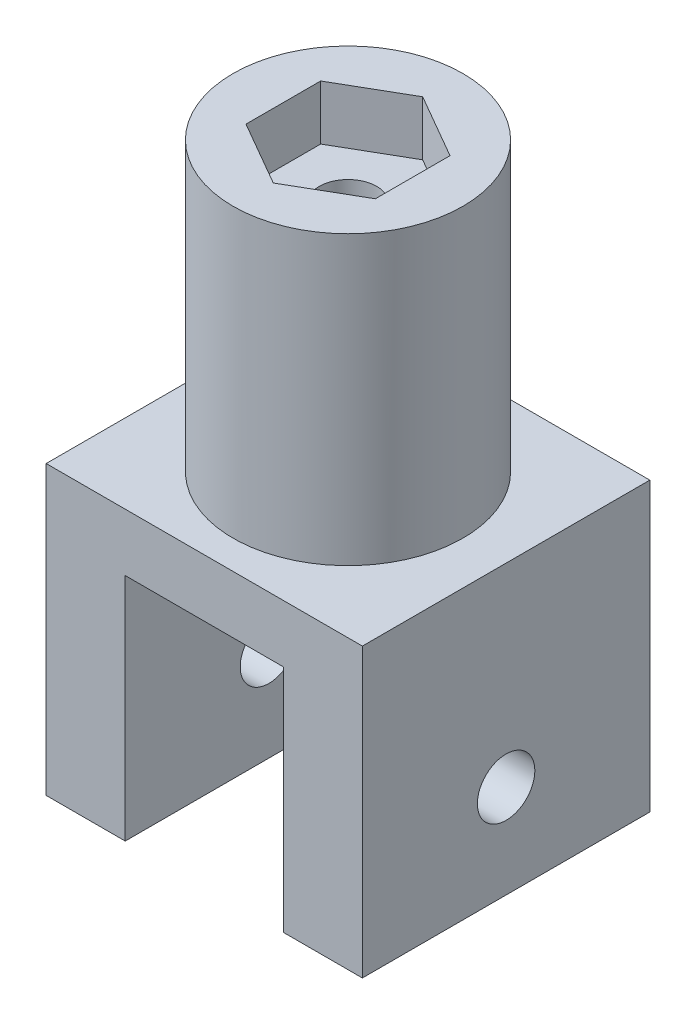
ISO-10303-21;
HEADER;
FILE_DESCRIPTION(('STEP AP214'),'2;1');
FILE_NAME('part.step','',(''),(''),'','','');
FILE_SCHEMA(('AUTOMOTIVE_DESIGN { 1 0 10303 214 1 1 1 1 }'));
ENDSEC;
DATA;
#1=APPLICATION_CONTEXT('core data for automotive mechanical design processes');
#2=APPLICATION_PROTOCOL_DEFINITION('international standard','automotive_design',2000,#1);
#3=PRODUCT_CONTEXT('',#1,'mechanical');
#4=PRODUCT('Part','Part','',(#3));
#5=PRODUCT_RELATED_PRODUCT_CATEGORY('part','',(#4));
#6=PRODUCT_DEFINITION_FORMATION('','',#4);
#7=PRODUCT_DEFINITION_CONTEXT('part definition',#1,'design');
#8=PRODUCT_DEFINITION('design','',#6,#7);
#9=PRODUCT_DEFINITION_SHAPE('','',#8);
#10=(LENGTH_UNIT() NAMED_UNIT(*) SI_UNIT(.MILLI.,.METRE.));
#11=(NAMED_UNIT(*) PLANE_ANGLE_UNIT() SI_UNIT($,.RADIAN.));
#12=(NAMED_UNIT(*) SI_UNIT($,.STERADIAN.) SOLID_ANGLE_UNIT());
#13=UNCERTAINTY_MEASURE_WITH_UNIT(LENGTH_MEASURE(1.E-05),#10,'distance_accuracy_value','');
#14=(GEOMETRIC_REPRESENTATION_CONTEXT(3) GLOBAL_UNCERTAINTY_ASSIGNED_CONTEXT((#13)) GLOBAL_UNIT_ASSIGNED_CONTEXT((#10,
#11,#12)) REPRESENTATION_CONTEXT('',''));
#15=CARTESIAN_POINT('',(0.,0.,0.));
#16=DIRECTION('',(0.,0.,1.));
#17=DIRECTION('',(1.,0.,0.));
#18=AXIS2_PLACEMENT_3D('',#15,#16,#17);
#19=CARTESIAN_POINT('',(0.,20.,0.));
#20=DIRECTION('',(0.,1.,0.));
#21=DIRECTION('',(0.,0.,1.));
#22=AXIS2_PLACEMENT_3D('',#19,#20,#21);
#23=PLANE('',#22);
#24=DIRECTION('',(0.,0.,-1.));
#25=VECTOR('',#24,1.);
#26=CARTESIAN_POINT('',(4.5,20.,2.59807621135332));
#27=LINE('',#26,#25);
#28=CARTESIAN_POINT('',(4.5,20.,2.59807621135332));
#29=VERTEX_POINT('',#28);
#30=CARTESIAN_POINT('',(4.5,20.,-2.59807621135332));
#31=VERTEX_POINT('',#30);
#32=EDGE_CURVE('E49',#29,#31,#27,.T.);
#33=ORIENTED_EDGE('',*,*,#32,.F.);
#34=DIRECTION('',(0.866025403784439,0.,-0.5));
#35=VECTOR('',#34,1.);
#36=CARTESIAN_POINT('',(0.,20.,5.19615242270663));
#37=LINE('',#36,#35);
#38=CARTESIAN_POINT('',(0.,20.,5.19615242270663));
#39=VERTEX_POINT('',#38);
#40=EDGE_CURVE('E157',#39,#29,#37,.T.);
#41=ORIENTED_EDGE('',*,*,#40,.F.);
#42=DIRECTION('',(0.866025403784439,0.,0.5));
#43=VECTOR('',#42,1.);
#44=CARTESIAN_POINT('',(-4.5,20.,2.59807621135332));
#45=LINE('',#44,#43);
#46=CARTESIAN_POINT('',(-4.5,20.,2.59807621135332));
#47=VERTEX_POINT('',#46);
#48=EDGE_CURVE('E160',#47,#39,#45,.T.);
#49=ORIENTED_EDGE('',*,*,#48,.F.);
#50=DIRECTION('',(0.,0.,1.));
#51=VECTOR('',#50,1.);
#52=CARTESIAN_POINT('',(-4.5,20.,-2.59807621135332));
#53=LINE('',#52,#51);
#54=CARTESIAN_POINT('',(-4.5,20.,-2.59807621135332));
#55=VERTEX_POINT('',#54);
#56=EDGE_CURVE('E176',#55,#47,#53,.T.);
#57=ORIENTED_EDGE('',*,*,#56,.F.);
#58=DIRECTION('',(-0.866025403784439,0.,0.5));
#59=VECTOR('',#58,1.);
#60=CARTESIAN_POINT('',(0.,20.,-5.19615242270663));
#61=LINE('',#60,#59);
#62=CARTESIAN_POINT('',(0.,20.,-5.19615242270663));
#63=VERTEX_POINT('',#62);
#64=EDGE_CURVE('E173',#63,#55,#61,.T.);
#65=ORIENTED_EDGE('',*,*,#64,.F.);
#66=DIRECTION('',(-0.866025403784439,0.,-0.5));
#67=VECTOR('',#66,1.);
#68=CARTESIAN_POINT('',(4.5,20.,-2.59807621135332));
#69=LINE('',#68,#67);
#70=EDGE_CURVE('E171',#31,#63,#69,.T.);
#71=ORIENTED_EDGE('',*,*,#70,.F.);
#72=EDGE_LOOP('',(#33,#41,#49,#57,#65,#71));
#73=FACE_BOUND('',#72,.T.);
#74=CARTESIAN_POINT('',(0.,20.,0.));
#75=DIRECTION('',(0.,1.,0.));
#76=DIRECTION('',(0.,0.,1.));
#77=AXIS2_PLACEMENT_3D('',#74,#75,#76);
#78=CIRCLE('',#77,8.);
#79=CARTESIAN_POINT('',(0.,20.,8.));
#80=VERTEX_POINT('',#79);
#81=EDGE_CURVE('E191',#80,#80,#78,.T.);
#82=ORIENTED_EDGE('',*,*,#81,.T.);
#83=EDGE_LOOP('',(#82));
#84=FACE_BOUND('',#83,.T.);
#85=ADVANCED_FACE('F33',(#73,#84),#23,.T.);
#86=CARTESIAN_POINT('',(0.,42.6274169979695,0.));
#87=DIRECTION('',(0.,-1.,0.));
#88=DIRECTION('',(0.,0.,-1.));
#89=AXIS2_PLACEMENT_3D('',#86,#87,#88);
#90=CYLINDRICAL_SURFACE('',#89,8.);
#91=CARTESIAN_POINT('',(0.,0.,0.));
#92=DIRECTION('',(0.,-1.,0.));
#93=DIRECTION('',(0.,0.,-1.));
#94=AXIS2_PLACEMENT_3D('',#91,#92,#93);
#95=CIRCLE('',#94,8.);
#96=CARTESIAN_POINT('',(0.,0.,-8.));
#97=VERTEX_POINT('',#96);
#98=EDGE_CURVE('E11',#97,#97,#95,.F.);
#99=ORIENTED_EDGE('',*,*,#98,.T.);
#100=EDGE_LOOP('',(#99));
#101=FACE_BOUND('',#100,.T.);
#102=ORIENTED_EDGE('',*,*,#81,.F.);
#103=EDGE_LOOP('',(#102));
#104=FACE_BOUND('',#103,.T.);
#105=ADVANCED_FACE('F280',(#101,#104),#90,.T.);
#106=CARTESIAN_POINT('',(-11.,-13.5,0.));
#107=DIRECTION('',(1.,0.,0.));
#108=DIRECTION('',(0.,0.,-1.));
#109=AXIS2_PLACEMENT_3D('',#106,#107,#108);
#110=CYLINDRICAL_SURFACE('',#109,2.);
#111=CARTESIAN_POINT('',(-5.5,-13.5,0.));
#112=DIRECTION('',(1.,0.,0.));
#113=DIRECTION('',(0.,0.,-1.));
#114=AXIS2_PLACEMENT_3D('',#111,#112,#113);
#115=CIRCLE('',#114,2.);
#116=CARTESIAN_POINT('',(-5.5,-13.5,-2.));
#117=VERTEX_POINT('',#116);
#118=EDGE_CURVE('E198',#117,#117,#115,.T.);
#119=ORIENTED_EDGE('',*,*,#118,.T.);
#120=EDGE_LOOP('',(#119));
#121=FACE_BOUND('',#120,.T.);
#122=CARTESIAN_POINT('',(-11.,-13.5,0.));
#123=DIRECTION('',(1.,0.,0.));
#124=DIRECTION('',(0.,0.,-1.));
#125=AXIS2_PLACEMENT_3D('',#122,#123,#124);
#126=CIRCLE('',#125,2.);
#127=CARTESIAN_POINT('',(-11.,-13.5,-2.));
#128=VERTEX_POINT('',#127);
#129=EDGE_CURVE('E195',#128,#128,#126,.T.);
#130=ORIENTED_EDGE('',*,*,#129,.F.);
#131=EDGE_LOOP('',(#130));
#132=FACE_BOUND('',#131,.T.);
#133=ADVANCED_FACE('F285',(#121,#132),#110,.F.);
#134=CARTESIAN_POINT('',(5.5,0.,-30.7424685126915));
#135=DIRECTION('',(-1.,0.,0.));
#136=DIRECTION('',(0.,0.,1.));
#137=AXIS2_PLACEMENT_3D('',#134,#135,#136);
#138=PLANE('',#137);
#139=CARTESIAN_POINT('',(5.5,-13.5,0.));
#140=DIRECTION('',(-1.,0.,0.));
#141=DIRECTION('',(0.,0.,1.));
#142=AXIS2_PLACEMENT_3D('',#139,#140,#141);
#143=CIRCLE('',#142,2.);
#144=CARTESIAN_POINT('',(5.5,-13.5,2.));
#145=VERTEX_POINT('',#144);
#146=EDGE_CURVE('E201',#145,#145,#143,.T.);
#147=ORIENTED_EDGE('',*,*,#146,.F.);
#148=EDGE_LOOP('',(#147));
#149=FACE_BOUND('',#148,.T.);
#150=DIRECTION('',(0.,-1.,0.));
#151=VECTOR('',#150,1.);
#152=CARTESIAN_POINT('',(5.5,0.,10.));
#153=LINE('',#152,#151);
#154=CARTESIAN_POINT('',(5.5,-4.,10.));
#155=VERTEX_POINT('',#154);
#156=CARTESIAN_POINT('',(5.5,-20.,10.));
#157=VERTEX_POINT('',#156);
#158=EDGE_CURVE('E222',#155,#157,#153,.T.);
#159=ORIENTED_EDGE('',*,*,#158,.F.);
#160=DIRECTION('',(0.,0.,-1.));
#161=VECTOR('',#160,1.);
#162=CARTESIAN_POINT('',(5.5,-4.,0.));
#163=LINE('',#162,#161);
#164=CARTESIAN_POINT('',(5.5,-4.,-10.));
#165=VERTEX_POINT('',#164);
#166=EDGE_CURVE('E229',#155,#165,#163,.T.);
#167=ORIENTED_EDGE('',*,*,#166,.T.);
#168=DIRECTION('',(0.,1.,0.));
#169=VECTOR('',#168,1.);
#170=CARTESIAN_POINT('',(5.5,0.,-10.));
#171=LINE('',#170,#169);
#172=CARTESIAN_POINT('',(5.5,-20.,-10.));
#173=VERTEX_POINT('',#172);
#174=EDGE_CURVE('E223',#173,#165,#171,.T.);
#175=ORIENTED_EDGE('',*,*,#174,.F.);
#176=DIRECTION('',(0.,0.,1.));
#177=VECTOR('',#176,1.);
#178=CARTESIAN_POINT('',(5.5,-20.,-30.7424685126915));
#179=LINE('',#178,#177);
#180=EDGE_CURVE('E234',#173,#157,#179,.T.);
#181=ORIENTED_EDGE('',*,*,#180,.T.);
#182=EDGE_LOOP('',(#159,#167,#175,#181));
#183=FACE_BOUND('',#182,.T.);
#184=ADVANCED_FACE('F319',(#149,#183),#138,.T.);
#185=CARTESIAN_POINT('',(-11.,-20.,-30.7424685126915));
#186=DIRECTION('',(0.,-1.,0.));
#187=DIRECTION('',(0.,0.,-1.));
#188=AXIS2_PLACEMENT_3D('',#185,#186,#187);
#189=PLANE('',#188);
#190=DIRECTION('',(-1.,0.,0.));
#191=VECTOR('',#190,1.);
#192=CARTESIAN_POINT('',(-11.,-20.,-10.));
#193=LINE('',#192,#191);
#194=CARTESIAN_POINT('',(-5.5,-20.,-10.));
#195=VERTEX_POINT('',#194);
#196=CARTESIAN_POINT('',(-11.,-20.,-10.));
#197=VERTEX_POINT('',#196);
#198=EDGE_CURVE('E207',#195,#197,#193,.T.);
#199=ORIENTED_EDGE('',*,*,#198,.F.);
#200=DIRECTION('',(0.,0.,1.));
#201=VECTOR('',#200,1.);
#202=CARTESIAN_POINT('',(-5.5,-20.,-30.7424685126915));
#203=LINE('',#202,#201);
#204=CARTESIAN_POINT('',(-5.5,-20.,10.));
#205=VERTEX_POINT('',#204);
#206=EDGE_CURVE('E208',#195,#205,#203,.T.);
#207=ORIENTED_EDGE('',*,*,#206,.T.);
#208=DIRECTION('',(1.,0.,0.));
#209=VECTOR('',#208,1.);
#210=CARTESIAN_POINT('',(-11.,-20.,10.));
#211=LINE('',#210,#209);
#212=CARTESIAN_POINT('',(-11.,-20.,10.));
#213=VERTEX_POINT('',#212);
#214=EDGE_CURVE('E204',#213,#205,#211,.T.);
#215=ORIENTED_EDGE('',*,*,#214,.F.);
#216=DIRECTION('',(0.,0.,1.));
#217=VECTOR('',#216,1.);
#218=CARTESIAN_POINT('',(-11.,-20.,-30.7424685126915));
#219=LINE('',#218,#217);
#220=EDGE_CURVE('E214',#197,#213,#219,.T.);
#221=ORIENTED_EDGE('',*,*,#220,.F.);
#222=EDGE_LOOP('',(#199,#207,#215,#221));
#223=FACE_BOUND('',#222,.T.);
#224=ADVANCED_FACE('F326',(#223),#189,.T.);
#225=CARTESIAN_POINT('',(-5.5,0.,-30.7424685126915));
#226=DIRECTION('',(1.,0.,0.));
#227=DIRECTION('',(0.,0.,-1.));
#228=AXIS2_PLACEMENT_3D('',#225,#226,#227);
#229=PLANE('',#228);
#230=ORIENTED_EDGE('',*,*,#118,.F.);
#231=EDGE_LOOP('',(#230));
#232=FACE_BOUND('',#231,.T.);
#233=DIRECTION('',(0.,-1.,0.));
#234=VECTOR('',#233,1.);
#235=CARTESIAN_POINT('',(-5.5,0.,-10.));
#236=LINE('',#235,#234);
#237=CARTESIAN_POINT('',(-5.5,-4.,-10.));
#238=VERTEX_POINT('',#237);
#239=EDGE_CURVE('E205',#238,#195,#236,.T.);
#240=ORIENTED_EDGE('',*,*,#239,.F.);
#241=DIRECTION('',(0.,0.,1.));
#242=VECTOR('',#241,1.);
#243=CARTESIAN_POINT('',(-5.5,-4.,0.));
#244=LINE('',#243,#242);
#245=CARTESIAN_POINT('',(-5.5,-4.,10.));
#246=VERTEX_POINT('',#245);
#247=EDGE_CURVE('E220',#238,#246,#244,.T.);
#248=ORIENTED_EDGE('',*,*,#247,.T.);
#249=DIRECTION('',(0.,1.,0.));
#250=VECTOR('',#249,1.);
#251=CARTESIAN_POINT('',(-5.5,0.,10.));
#252=LINE('',#251,#250);
#253=EDGE_CURVE('E211',#205,#246,#252,.T.);
#254=ORIENTED_EDGE('',*,*,#253,.F.);
#255=ORIENTED_EDGE('',*,*,#206,.F.);
#256=EDGE_LOOP('',(#240,#248,#254,#255));
#257=FACE_BOUND('',#256,.T.);
#258=ADVANCED_FACE('F322',(#232,#257),#229,.T.);
#259=CARTESIAN_POINT('',(0.,-4.,0.));
#260=DIRECTION('',(0.,-1.,0.));
#261=DIRECTION('',(0.,0.,-1.));
#262=AXIS2_PLACEMENT_3D('',#259,#260,#261);
#263=PLANE('',#262);
#264=CARTESIAN_POINT('',(0.,-4.,0.));
#265=DIRECTION('',(0.,-1.,0.));
#266=DIRECTION('',(0.,0.,-1.));
#267=AXIS2_PLACEMENT_3D('',#264,#265,#266);
#268=CIRCLE('',#267,2.);
#269=CARTESIAN_POINT('',(0.,-4.,-2.));
#270=VERTEX_POINT('',#269);
#271=EDGE_CURVE('E36',#270,#270,#268,.T.);
#272=ORIENTED_EDGE('',*,*,#271,.F.);
#273=EDGE_LOOP('',(#272));
#274=FACE_BOUND('',#273,.T.);
#275=ORIENTED_EDGE('',*,*,#247,.F.);
#276=DIRECTION('',(1.,0.,0.));
#277=VECTOR('',#276,1.);
#278=CARTESIAN_POINT('',(-11.,-4.,-10.));
#279=LINE('',#278,#277);
#280=EDGE_CURVE('E243',#238,#165,#279,.T.);
#281=ORIENTED_EDGE('',*,*,#280,.T.);
#282=ORIENTED_EDGE('',*,*,#166,.F.);
#283=DIRECTION('',(-1.,0.,0.));
#284=VECTOR('',#283,1.);
#285=CARTESIAN_POINT('',(-11.,-4.,10.));
#286=LINE('',#285,#284);
#287=EDGE_CURVE('E57',#155,#246,#286,.T.);
#288=ORIENTED_EDGE('',*,*,#287,.T.);
#289=EDGE_LOOP('',(#275,#281,#282,#288));
#290=FACE_BOUND('',#289,.T.);
#291=ADVANCED_FACE('F325',(#274,#290),#263,.T.);
#292=CARTESIAN_POINT('',(11.,-20.,-30.7424685126915));
#293=DIRECTION('',(0.,-1.,0.));
#294=DIRECTION('',(0.,0.,-1.));
#295=AXIS2_PLACEMENT_3D('',#292,#293,#294);
#296=PLANE('',#295);
#297=DIRECTION('',(-1.,0.,0.));
#298=VECTOR('',#297,1.);
#299=CARTESIAN_POINT('',(11.,-20.,-10.));
#300=LINE('',#299,#298);
#301=CARTESIAN_POINT('',(11.,-20.,-10.));
#302=VERTEX_POINT('',#301);
#303=EDGE_CURVE('E226',#302,#173,#300,.T.);
#304=ORIENTED_EDGE('',*,*,#303,.F.);
#305=DIRECTION('',(0.,0.,1.));
#306=VECTOR('',#305,1.);
#307=CARTESIAN_POINT('',(11.,-20.,-30.7424685126915));
#308=LINE('',#307,#306);
#309=CARTESIAN_POINT('',(11.,-20.,10.));
#310=VERTEX_POINT('',#309);
#311=EDGE_CURVE('E227',#302,#310,#308,.T.);
#312=ORIENTED_EDGE('',*,*,#311,.T.);
#313=DIRECTION('',(1.,0.,0.));
#314=VECTOR('',#313,1.);
#315=CARTESIAN_POINT('',(11.,-20.,10.));
#316=LINE('',#315,#314);
#317=EDGE_CURVE('E231',#157,#310,#316,.T.);
#318=ORIENTED_EDGE('',*,*,#317,.F.);
#319=ORIENTED_EDGE('',*,*,#180,.F.);
#320=EDGE_LOOP('',(#304,#312,#318,#319));
#321=FACE_BOUND('',#320,.T.);
#322=ADVANCED_FACE('F331',(#321),#296,.T.);
#323=ORIENTED_EDGE('',*,*,#146,.T.);
#324=EDGE_LOOP('',(#323));
#325=FACE_BOUND('',#324,.T.);
#326=CARTESIAN_POINT('',(11.,-13.5,0.));
#327=DIRECTION('',(1.,0.,0.));
#328=DIRECTION('',(0.,0.,-1.));
#329=AXIS2_PLACEMENT_3D('',#326,#327,#328);
#330=CIRCLE('',#329,2.);
#331=CARTESIAN_POINT('',(11.,-13.5,-2.));
#332=VERTEX_POINT('',#331);
#333=EDGE_CURVE('E194',#332,#332,#330,.T.);
#334=ORIENTED_EDGE('',*,*,#333,.T.);
#335=EDGE_LOOP('',(#334));
#336=FACE_BOUND('',#335,.T.);
#337=ADVANCED_FACE('F321',(#325,#336),#110,.F.);
#338=CARTESIAN_POINT('',(-11.,-4.,10.));
#339=DIRECTION('',(0.,0.,-1.));
#340=DIRECTION('',(-1.,0.,0.));
#341=AXIS2_PLACEMENT_3D('',#338,#339,#340);
#342=PLANE('',#341);
#343=DIRECTION('',(-1.,0.,0.));
#344=VECTOR('',#343,1.);
#345=CARTESIAN_POINT('',(-11.,0.,10.));
#346=LINE('',#345,#344);
#347=CARTESIAN_POINT('',(11.,0.,10.));
#348=VERTEX_POINT('',#347);
#349=CARTESIAN_POINT('',(-11.,0.,10.));
#350=VERTEX_POINT('',#349);
#351=EDGE_CURVE('E241',#348,#350,#346,.T.);
#352=ORIENTED_EDGE('',*,*,#351,.T.);
#353=DIRECTION('',(0.,1.,0.));
#354=VECTOR('',#353,1.);
#355=CARTESIAN_POINT('',(-11.,-4.,10.));
#356=LINE('',#355,#354);
#357=EDGE_CURVE('E41',#213,#350,#356,.T.);
#358=ORIENTED_EDGE('',*,*,#357,.F.);
#359=ORIENTED_EDGE('',*,*,#214,.T.);
#360=ORIENTED_EDGE('',*,*,#253,.T.);
#361=ORIENTED_EDGE('',*,*,#287,.F.);
#362=ORIENTED_EDGE('',*,*,#158,.T.);
#363=ORIENTED_EDGE('',*,*,#317,.T.);
#364=DIRECTION('',(0.,1.,0.));
#365=VECTOR('',#364,1.);
#366=CARTESIAN_POINT('',(11.,-4.,10.));
#367=LINE('',#366,#365);
#368=EDGE_CURVE('E246',#310,#348,#367,.T.);
#369=ORIENTED_EDGE('',*,*,#368,.T.);
#370=EDGE_LOOP('',(#352,#358,#359,#360,#361,#362,#363,#369));
#371=FACE_BOUND('',#370,.T.);
#372=ADVANCED_FACE('F355',(#371),#342,.F.);
#373=CARTESIAN_POINT('',(-11.,-4.,10.));
#374=DIRECTION('',(1.,0.,0.));
#375=DIRECTION('',(0.,0.,-1.));
#376=AXIS2_PLACEMENT_3D('',#373,#374,#375);
#377=PLANE('',#376);
#378=ORIENTED_EDGE('',*,*,#129,.T.);
#379=EDGE_LOOP('',(#378));
#380=FACE_BOUND('',#379,.T.);
#381=DIRECTION('',(0.,0.,-1.));
#382=VECTOR('',#381,1.);
#383=CARTESIAN_POINT('',(-11.,0.,10.));
#384=LINE('',#383,#382);
#385=CARTESIAN_POINT('',(-11.,0.,-10.));
#386=VERTEX_POINT('',#385);
#387=EDGE_CURVE('E248',#350,#386,#384,.T.);
#388=ORIENTED_EDGE('',*,*,#387,.T.);
#389=DIRECTION('',(0.,1.,0.));
#390=VECTOR('',#389,1.);
#391=CARTESIAN_POINT('',(-11.,-4.,-10.));
#392=LINE('',#391,#390);
#393=EDGE_CURVE('E258',#197,#386,#392,.T.);
#394=ORIENTED_EDGE('',*,*,#393,.F.);
#395=ORIENTED_EDGE('',*,*,#220,.T.);
#396=ORIENTED_EDGE('',*,*,#357,.T.);
#397=EDGE_LOOP('',(#388,#394,#395,#396));
#398=FACE_BOUND('',#397,.T.);
#399=ADVANCED_FACE('F351',(#380,#398),#377,.F.);
#400=CARTESIAN_POINT('',(-11.,-4.,-10.));
#401=DIRECTION('',(0.,0.,1.));
#402=DIRECTION('',(1.,0.,0.));
#403=AXIS2_PLACEMENT_3D('',#400,#401,#402);
#404=PLANE('',#403);
#405=ORIENTED_EDGE('',*,*,#280,.F.);
#406=ORIENTED_EDGE('',*,*,#239,.T.);
#407=ORIENTED_EDGE('',*,*,#198,.T.);
#408=ORIENTED_EDGE('',*,*,#393,.T.);
#409=DIRECTION('',(1.,0.,0.));
#410=VECTOR('',#409,1.);
#411=CARTESIAN_POINT('',(-11.,0.,-10.));
#412=LINE('',#411,#410);
#413=CARTESIAN_POINT('',(11.,0.,-10.));
#414=VERTEX_POINT('',#413);
#415=EDGE_CURVE('E250',#386,#414,#412,.T.);
#416=ORIENTED_EDGE('',*,*,#415,.T.);
#417=DIRECTION('',(0.,1.,0.));
#418=VECTOR('',#417,1.);
#419=CARTESIAN_POINT('',(11.,-4.,-10.));
#420=LINE('',#419,#418);
#421=EDGE_CURVE('E255',#302,#414,#420,.T.);
#422=ORIENTED_EDGE('',*,*,#421,.F.);
#423=ORIENTED_EDGE('',*,*,#303,.T.);
#424=ORIENTED_EDGE('',*,*,#174,.T.);
#425=EDGE_LOOP('',(#405,#406,#407,#408,#416,#422,#423,#424));
#426=FACE_BOUND('',#425,.T.);
#427=ADVANCED_FACE('F347',(#426),#404,.F.);
#428=CARTESIAN_POINT('',(11.,-4.,-10.));
#429=DIRECTION('',(-1.,0.,0.));
#430=DIRECTION('',(0.,0.,1.));
#431=AXIS2_PLACEMENT_3D('',#428,#429,#430);
#432=PLANE('',#431);
#433=ORIENTED_EDGE('',*,*,#333,.F.);
#434=EDGE_LOOP('',(#433));
#435=FACE_BOUND('',#434,.T.);
#436=DIRECTION('',(0.,0.,1.));
#437=VECTOR('',#436,1.);
#438=CARTESIAN_POINT('',(11.,0.,-10.));
#439=LINE('',#438,#437);
#440=EDGE_CURVE('E244',#414,#348,#439,.T.);
#441=ORIENTED_EDGE('',*,*,#440,.T.);
#442=ORIENTED_EDGE('',*,*,#368,.F.);
#443=ORIENTED_EDGE('',*,*,#311,.F.);
#444=ORIENTED_EDGE('',*,*,#421,.T.);
#445=EDGE_LOOP('',(#441,#442,#443,#444));
#446=FACE_BOUND('',#445,.T.);
#447=ADVANCED_FACE('F343',(#435,#446),#432,.F.);
#448=CARTESIAN_POINT('',(0.,0.,0.));
#449=DIRECTION('',(0.,-1.,0.));
#450=DIRECTION('',(0.,0.,-1.));
#451=AXIS2_PLACEMENT_3D('',#448,#449,#450);
#452=PLANE('',#451);
#453=ORIENTED_EDGE('',*,*,#440,.F.);
#454=ORIENTED_EDGE('',*,*,#415,.F.);
#455=ORIENTED_EDGE('',*,*,#387,.F.);
#456=ORIENTED_EDGE('',*,*,#351,.F.);
#457=EDGE_LOOP('',(#453,#454,#455,#456));
#458=FACE_BOUND('',#457,.T.);
#459=ORIENTED_EDGE('',*,*,#98,.F.);
#460=EDGE_LOOP('',(#459));
#461=FACE_BOUND('',#460,.T.);
#462=ADVANCED_FACE('F310',(#458,#461),#452,.F.);
#463=CARTESIAN_POINT('',(4.5,16.2,2.59807621135332));
#464=DIRECTION('',(1.,0.,0.));
#465=DIRECTION('',(0.,0.,-1.));
#466=AXIS2_PLACEMENT_3D('',#463,#464,#465);
#467=PLANE('',#466);
#468=ORIENTED_EDGE('',*,*,#32,.T.);
#469=DIRECTION('',(0.,1.,0.));
#470=VECTOR('',#469,1.);
#471=CARTESIAN_POINT('',(4.5,16.2,-2.59807621135332));
#472=LINE('',#471,#470);
#473=CARTESIAN_POINT('',(4.5,16.2,-2.59807621135332));
#474=VERTEX_POINT('',#473);
#475=EDGE_CURVE('E134',#474,#31,#472,.T.);
#476=ORIENTED_EDGE('',*,*,#475,.F.);
#477=DIRECTION('',(0.,0.,-1.));
#478=VECTOR('',#477,1.);
#479=CARTESIAN_POINT('',(4.5,16.2,2.59807621135332));
#480=LINE('',#479,#478);
#481=CARTESIAN_POINT('',(4.5,16.2,2.59807621135332));
#482=VERTEX_POINT('',#481);
#483=EDGE_CURVE('E138',#482,#474,#480,.T.);
#484=ORIENTED_EDGE('',*,*,#483,.F.);
#485=DIRECTION('',(0.,1.,0.));
#486=VECTOR('',#485,1.);
#487=CARTESIAN_POINT('',(4.5,16.2,2.59807621135332));
#488=LINE('',#487,#486);
#489=EDGE_CURVE('E181',#482,#29,#488,.T.);
#490=ORIENTED_EDGE('',*,*,#489,.T.);
#491=EDGE_LOOP('',(#468,#476,#484,#490));
#492=FACE_BOUND('',#491,.T.);
#493=ADVANCED_FACE('F136',(#492),#467,.F.);
#494=CARTESIAN_POINT('',(0.,16.2,5.19615242270663));
#495=DIRECTION('',(0.5,0.,0.866025403784439));
#496=DIRECTION('',(0.866025403784439,0.,-0.5));
#497=AXIS2_PLACEMENT_3D('',#494,#495,#496);
#498=PLANE('',#497);
#499=ORIENTED_EDGE('',*,*,#40,.T.);
#500=ORIENTED_EDGE('',*,*,#489,.F.);
#501=DIRECTION('',(0.866025403784439,0.,-0.5));
#502=VECTOR('',#501,1.);
#503=CARTESIAN_POINT('',(0.,16.2,5.19615242270663));
#504=LINE('',#503,#502);
#505=CARTESIAN_POINT('',(0.,16.2,5.19615242270663));
#506=VERTEX_POINT('',#505);
#507=EDGE_CURVE('E144',#506,#482,#504,.T.);
#508=ORIENTED_EDGE('',*,*,#507,.F.);
#509=DIRECTION('',(0.,1.,0.));
#510=VECTOR('',#509,1.);
#511=CARTESIAN_POINT('',(0.,16.2,5.19615242270663));
#512=LINE('',#511,#510);
#513=EDGE_CURVE('E184',#506,#39,#512,.T.);
#514=ORIENTED_EDGE('',*,*,#513,.T.);
#515=EDGE_LOOP('',(#499,#500,#508,#514));
#516=FACE_BOUND('',#515,.T.);
#517=ADVANCED_FACE('F303',(#516),#498,.F.);
#518=CARTESIAN_POINT('',(-4.5,16.2,2.59807621135332));
#519=DIRECTION('',(-0.5,0.,0.866025403784439));
#520=DIRECTION('',(0.866025403784439,0.,0.5));
#521=AXIS2_PLACEMENT_3D('',#518,#519,#520);
#522=PLANE('',#521);
#523=ORIENTED_EDGE('',*,*,#48,.T.);
#524=ORIENTED_EDGE('',*,*,#513,.F.);
#525=DIRECTION('',(0.866025403784439,0.,0.5));
#526=VECTOR('',#525,1.);
#527=CARTESIAN_POINT('',(-4.5,16.2,2.59807621135332));
#528=LINE('',#527,#526);
#529=CARTESIAN_POINT('',(-4.5,16.2,2.59807621135332));
#530=VERTEX_POINT('',#529);
#531=EDGE_CURVE('E167',#530,#506,#528,.T.);
#532=ORIENTED_EDGE('',*,*,#531,.F.);
#533=DIRECTION('',(0.,1.,0.));
#534=VECTOR('',#533,1.);
#535=CARTESIAN_POINT('',(-4.5,16.2,2.59807621135332));
#536=LINE('',#535,#534);
#537=EDGE_CURVE('E186',#530,#47,#536,.T.);
#538=ORIENTED_EDGE('',*,*,#537,.T.);
#539=EDGE_LOOP('',(#523,#524,#532,#538));
#540=FACE_BOUND('',#539,.T.);
#541=ADVANCED_FACE('F301',(#540),#522,.F.);
#542=CARTESIAN_POINT('',(-4.5,16.2,-2.59807621135332));
#543=DIRECTION('',(-1.,0.,0.));
#544=DIRECTION('',(0.,0.,1.));
#545=AXIS2_PLACEMENT_3D('',#542,#543,#544);
#546=PLANE('',#545);
#547=ORIENTED_EDGE('',*,*,#56,.T.);
#548=ORIENTED_EDGE('',*,*,#537,.F.);
#549=DIRECTION('',(0.,0.,1.));
#550=VECTOR('',#549,1.);
#551=CARTESIAN_POINT('',(-4.5,16.2,-2.59807621135332));
#552=LINE('',#551,#550);
#553=CARTESIAN_POINT('',(-4.5,16.2,-2.59807621135332));
#554=VERTEX_POINT('',#553);
#555=EDGE_CURVE('E164',#554,#530,#552,.T.);
#556=ORIENTED_EDGE('',*,*,#555,.F.);
#557=DIRECTION('',(0.,1.,0.));
#558=VECTOR('',#557,1.);
#559=CARTESIAN_POINT('',(-4.5,16.2,-2.59807621135332));
#560=LINE('',#559,#558);
#561=EDGE_CURVE('E188',#554,#55,#560,.T.);
#562=ORIENTED_EDGE('',*,*,#561,.T.);
#563=EDGE_LOOP('',(#547,#548,#556,#562));
#564=FACE_BOUND('',#563,.T.);
#565=ADVANCED_FACE('F299',(#564),#546,.F.);
#566=CARTESIAN_POINT('',(0.,16.2,-5.19615242270663));
#567=DIRECTION('',(-0.5,0.,-0.866025403784439));
#568=DIRECTION('',(-0.866025403784439,0.,0.5));
#569=AXIS2_PLACEMENT_3D('',#566,#567,#568);
#570=PLANE('',#569);
#571=ORIENTED_EDGE('',*,*,#64,.T.);
#572=ORIENTED_EDGE('',*,*,#561,.F.);
#573=DIRECTION('',(-0.866025403784439,0.,0.5));
#574=VECTOR('',#573,1.);
#575=CARTESIAN_POINT('',(0.,16.2,-5.19615242270663));
#576=LINE('',#575,#574);
#577=CARTESIAN_POINT('',(0.,16.2,-5.19615242270663));
#578=VERTEX_POINT('',#577);
#579=EDGE_CURVE('E152',#578,#554,#576,.T.);
#580=ORIENTED_EDGE('',*,*,#579,.F.);
#581=DIRECTION('',(0.,1.,0.));
#582=VECTOR('',#581,1.);
#583=CARTESIAN_POINT('',(0.,16.2,-5.19615242270663));
#584=LINE('',#583,#582);
#585=EDGE_CURVE('E143',#578,#63,#584,.T.);
#586=ORIENTED_EDGE('',*,*,#585,.T.);
#587=EDGE_LOOP('',(#571,#572,#580,#586));
#588=FACE_BOUND('',#587,.T.);
#589=ADVANCED_FACE('F276',(#588),#570,.F.);
#590=CARTESIAN_POINT('',(4.5,16.2,-2.59807621135332));
#591=DIRECTION('',(0.5,0.,-0.866025403784439));
#592=DIRECTION('',(-0.866025403784439,0.,-0.5));
#593=AXIS2_PLACEMENT_3D('',#590,#591,#592);
#594=PLANE('',#593);
#595=ORIENTED_EDGE('',*,*,#70,.T.);
#596=ORIENTED_EDGE('',*,*,#585,.F.);
#597=DIRECTION('',(-0.866025403784439,0.,-0.5));
#598=VECTOR('',#597,1.);
#599=CARTESIAN_POINT('',(4.5,16.2,-2.59807621135332));
#600=LINE('',#599,#598);
#601=EDGE_CURVE('E147',#474,#578,#600,.T.);
#602=ORIENTED_EDGE('',*,*,#601,.F.);
#603=ORIENTED_EDGE('',*,*,#475,.T.);
#604=EDGE_LOOP('',(#595,#596,#602,#603));
#605=FACE_BOUND('',#604,.T.);
#606=ADVANCED_FACE('F148',(#605),#594,.F.);
#607=CARTESIAN_POINT('',(0.,16.2,0.));
#608=DIRECTION('',(0.,1.,0.));
#609=DIRECTION('',(0.,0.,1.));
#610=AXIS2_PLACEMENT_3D('',#607,#608,#609);
#611=PLANE('',#610);
#612=CARTESIAN_POINT('',(0.,16.2,0.));
#613=DIRECTION('',(0.,1.,0.));
#614=DIRECTION('',(0.,0.,1.));
#615=AXIS2_PLACEMENT_3D('',#612,#613,#614);
#616=CIRCLE('',#615,2.);
#617=CARTESIAN_POINT('',(0.,16.2,2.));
#618=VERTEX_POINT('',#617);
#619=EDGE_CURVE('E183',#618,#618,#616,.T.);
#620=ORIENTED_EDGE('',*,*,#619,.F.);
#621=EDGE_LOOP('',(#620));
#622=FACE_BOUND('',#621,.T.);
#623=ORIENTED_EDGE('',*,*,#483,.T.);
#624=ORIENTED_EDGE('',*,*,#601,.T.);
#625=ORIENTED_EDGE('',*,*,#579,.T.);
#626=ORIENTED_EDGE('',*,*,#555,.T.);
#627=ORIENTED_EDGE('',*,*,#531,.T.);
#628=ORIENTED_EDGE('',*,*,#507,.T.);
#629=EDGE_LOOP('',(#623,#624,#625,#626,#627,#628));
#630=FACE_BOUND('',#629,.T.);
#631=ADVANCED_FACE('F154',(#622,#630),#611,.T.);
#632=CARTESIAN_POINT('',(0.,20.,0.));
#633=DIRECTION('',(0.,-1.,0.));
#634=DIRECTION('',(0.,0.,-1.));
#635=AXIS2_PLACEMENT_3D('',#632,#633,#634);
#636=CYLINDRICAL_SURFACE('',#635,2.);
#637=ORIENTED_EDGE('',*,*,#619,.T.);
#638=EDGE_LOOP('',(#637));
#639=FACE_BOUND('',#638,.T.);
#640=ORIENTED_EDGE('',*,*,#271,.T.);
#641=EDGE_LOOP('',(#640));
#642=FACE_BOUND('',#641,.T.);
#643=ADVANCED_FACE('F267',(#639,#642),#636,.F.);
#644=CLOSED_SHELL('',(#85,#105,#133,#184,#224,#258,#291,#322,#337,#372,#399,#427,#447,#462,#493,
#517,#541,#565,#589,#606,#631,#643));
#645=MANIFOLD_SOLID_BREP('B2',#644);
#646=ADVANCED_BREP_SHAPE_REPRESENTATION('',(#18,#645),#14);
#647=SHAPE_DEFINITION_REPRESENTATION(#9,#646);
ENDSEC;
END-ISO-10303-21;
